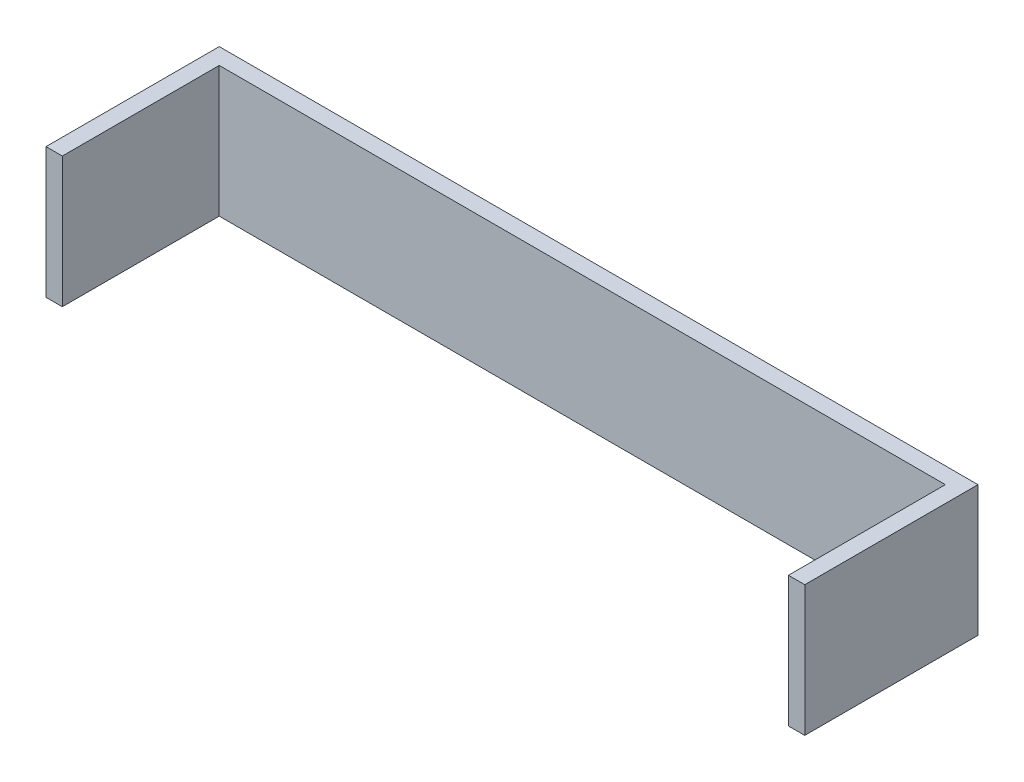
ISO-10303-21;
HEADER;
FILE_DESCRIPTION(('STEP AP214'),'2;1');
FILE_NAME('part.step','',(''),(''),'','','');
FILE_SCHEMA(('AUTOMOTIVE_DESIGN { 1 0 10303 214 1 1 1 1 }'));
ENDSEC;
DATA;
#1=APPLICATION_CONTEXT('core data for automotive mechanical design processes');
#2=APPLICATION_PROTOCOL_DEFINITION('international standard','automotive_design',2000,#1);
#3=PRODUCT_CONTEXT('',#1,'mechanical');
#4=PRODUCT('Part','Part','',(#3));
#5=PRODUCT_RELATED_PRODUCT_CATEGORY('part','',(#4));
#6=PRODUCT_DEFINITION_FORMATION('','',#4);
#7=PRODUCT_DEFINITION_CONTEXT('part definition',#1,'design');
#8=PRODUCT_DEFINITION('design','',#6,#7);
#9=PRODUCT_DEFINITION_SHAPE('','',#8);
#10=(LENGTH_UNIT() NAMED_UNIT(*) SI_UNIT(.MILLI.,.METRE.));
#11=(NAMED_UNIT(*) PLANE_ANGLE_UNIT() SI_UNIT($,.RADIAN.));
#12=(NAMED_UNIT(*) SI_UNIT($,.STERADIAN.) SOLID_ANGLE_UNIT());
#13=UNCERTAINTY_MEASURE_WITH_UNIT(LENGTH_MEASURE(1.E-05),#10,'distance_accuracy_value','');
#14=(GEOMETRIC_REPRESENTATION_CONTEXT(3) GLOBAL_UNCERTAINTY_ASSIGNED_CONTEXT((#13)) GLOBAL_UNIT_ASSIGNED_CONTEXT((#10,
#11,#12)) REPRESENTATION_CONTEXT('',''));
#15=CARTESIAN_POINT('',(0.,0.,0.));
#16=DIRECTION('',(0.,0.,1.));
#17=DIRECTION('',(1.,0.,0.));
#18=AXIS2_PLACEMENT_3D('',#15,#16,#17);
#19=CARTESIAN_POINT('',(0.,0.,3.175));
#20=DIRECTION('',(0.,0.,-1.));
#21=DIRECTION('',(-1.,0.,0.));
#22=AXIS2_PLACEMENT_3D('',#19,#20,#21);
#23=PLANE('',#22);
#24=DIRECTION('',(1.,0.,0.));
#25=VECTOR('',#24,1.);
#26=CARTESIAN_POINT('',(-73.81875,-12.7,3.175));
#27=LINE('',#26,#25);
#28=CARTESIAN_POINT('',(-70.64375,-12.7,3.175));
#29=VERTEX_POINT('',#28);
#30=CARTESIAN_POINT('',(70.64375,-12.7,3.175));
#31=VERTEX_POINT('',#30);
#32=EDGE_CURVE('E64',#29,#31,#27,.T.);
#33=ORIENTED_EDGE('',*,*,#32,.T.);
#34=DIRECTION('',(0.,1.,0.));
#35=VECTOR('',#34,1.);
#36=CARTESIAN_POINT('',(70.64375,12.7,3.175));
#37=LINE('',#36,#35);
#38=CARTESIAN_POINT('',(70.64375,12.7,3.175));
#39=VERTEX_POINT('',#38);
#40=EDGE_CURVE('E59',#31,#39,#37,.T.);
#41=ORIENTED_EDGE('',*,*,#40,.T.);
#42=DIRECTION('',(-1.,0.,0.));
#43=VECTOR('',#42,1.);
#44=CARTESIAN_POINT('',(-73.81875,12.7,3.175));
#45=LINE('',#44,#43);
#46=CARTESIAN_POINT('',(-70.64375,12.7,3.175));
#47=VERTEX_POINT('',#46);
#48=EDGE_CURVE('E170',#39,#47,#45,.T.);
#49=ORIENTED_EDGE('',*,*,#48,.T.);
#50=DIRECTION('',(0.,1.,0.));
#51=VECTOR('',#50,1.);
#52=CARTESIAN_POINT('',(-70.64375,12.7,3.175));
#53=LINE('',#52,#51);
#54=EDGE_CURVE('E144',#29,#47,#53,.T.);
#55=ORIENTED_EDGE('',*,*,#54,.F.);
#56=EDGE_LOOP('',(#33,#41,#49,#55));
#57=FACE_BOUND('',#56,.T.);
#58=ADVANCED_FACE('F43',(#57),#23,.F.);
#59=CARTESIAN_POINT('',(73.81875,-12.7,3.175));
#60=DIRECTION('',(-1.,0.,0.));
#61=DIRECTION('',(0.,0.,1.));
#62=AXIS2_PLACEMENT_3D('',#59,#60,#61);
#63=PLANE('',#62);
#64=DIRECTION('',(0.,1.,0.));
#65=VECTOR('',#64,1.);
#66=CARTESIAN_POINT('',(73.81875,-12.7,0.));
#67=LINE('',#66,#65);
#68=CARTESIAN_POINT('',(73.81875,-12.7,0.));
#69=VERTEX_POINT('',#68);
#70=CARTESIAN_POINT('',(73.81875,12.7,0.));
#71=VERTEX_POINT('',#70);
#72=EDGE_CURVE('E113',#69,#71,#67,.T.);
#73=ORIENTED_EDGE('',*,*,#72,.T.);
#74=DIRECTION('',(0.,0.,-1.));
#75=VECTOR('',#74,1.);
#76=CARTESIAN_POINT('',(73.81875,12.7,3.175));
#77=LINE('',#76,#75);
#78=CARTESIAN_POINT('',(73.81875,12.7,33.71088));
#79=VERTEX_POINT('',#78);
#80=EDGE_CURVE('E11',#79,#71,#77,.T.);
#81=ORIENTED_EDGE('',*,*,#80,.F.);
#82=DIRECTION('',(0.,-1.,0.));
#83=VECTOR('',#82,1.);
#84=CARTESIAN_POINT('',(73.81875,12.7,33.71088));
#85=LINE('',#84,#83);
#86=CARTESIAN_POINT('',(73.81875,-12.7,33.71088));
#87=VERTEX_POINT('',#86);
#88=EDGE_CURVE('E110',#79,#87,#85,.T.);
#89=ORIENTED_EDGE('',*,*,#88,.T.);
#90=DIRECTION('',(0.,0.,-1.));
#91=VECTOR('',#90,1.);
#92=CARTESIAN_POINT('',(73.81875,-12.7,3.175));
#93=LINE('',#92,#91);
#94=EDGE_CURVE('E176',#87,#69,#93,.T.);
#95=ORIENTED_EDGE('',*,*,#94,.T.);
#96=EDGE_LOOP('',(#73,#81,#89,#95));
#97=FACE_BOUND('',#96,.T.);
#98=ADVANCED_FACE('F45',(#97),#63,.F.);
#99=CARTESIAN_POINT('',(-73.81875,12.7,3.175));
#100=DIRECTION('',(0.,-1.,0.));
#101=DIRECTION('',(0.,0.,-1.));
#102=AXIS2_PLACEMENT_3D('',#99,#100,#101);
#103=PLANE('',#102);
#104=DIRECTION('',(-1.,0.,0.));
#105=VECTOR('',#104,1.);
#106=CARTESIAN_POINT('',(-73.81875,12.7,0.));
#107=LINE('',#106,#105);
#108=CARTESIAN_POINT('',(-73.81875,12.7,0.));
#109=VERTEX_POINT('',#108);
#110=EDGE_CURVE('E179',#71,#109,#107,.T.);
#111=ORIENTED_EDGE('',*,*,#110,.T.);
#112=DIRECTION('',(0.,0.,-1.));
#113=VECTOR('',#112,1.);
#114=CARTESIAN_POINT('',(-73.81875,12.7,3.175));
#115=LINE('',#114,#113);
#116=CARTESIAN_POINT('',(-73.81875,12.7,33.71088));
#117=VERTEX_POINT('',#116);
#118=EDGE_CURVE('E52',#117,#109,#115,.T.);
#119=ORIENTED_EDGE('',*,*,#118,.F.);
#120=DIRECTION('',(-1.,0.,0.));
#121=VECTOR('',#120,1.);
#122=CARTESIAN_POINT('',(-73.81875,12.7,33.71088));
#123=LINE('',#122,#121);
#124=CARTESIAN_POINT('',(-70.64375,12.7,33.71088));
#125=VERTEX_POINT('',#124);
#126=EDGE_CURVE('E155',#125,#117,#123,.T.);
#127=ORIENTED_EDGE('',*,*,#126,.F.);
#128=DIRECTION('',(0.,0.,-1.));
#129=VECTOR('',#128,1.);
#130=CARTESIAN_POINT('',(-70.64375,12.7,33.71088));
#131=LINE('',#130,#129);
#132=EDGE_CURVE('E159',#125,#47,#131,.T.);
#133=ORIENTED_EDGE('',*,*,#132,.T.);
#134=ORIENTED_EDGE('',*,*,#48,.F.);
#135=DIRECTION('',(0.,0.,-1.));
#136=VECTOR('',#135,1.);
#137=CARTESIAN_POINT('',(70.64375,12.7,33.71088));
#138=LINE('',#137,#136);
#139=CARTESIAN_POINT('',(70.64375,12.7,33.71088));
#140=VERTEX_POINT('',#139);
#141=EDGE_CURVE('E128',#140,#39,#138,.T.);
#142=ORIENTED_EDGE('',*,*,#141,.F.);
#143=DIRECTION('',(1.,0.,0.));
#144=VECTOR('',#143,1.);
#145=CARTESIAN_POINT('',(73.81875,12.7,33.71088));
#146=LINE('',#145,#144);
#147=EDGE_CURVE('E120',#140,#79,#146,.T.);
#148=ORIENTED_EDGE('',*,*,#147,.T.);
#149=ORIENTED_EDGE('',*,*,#80,.T.);
#150=EDGE_LOOP('',(#111,#119,#127,#133,#134,#142,#148,#149));
#151=FACE_BOUND('',#150,.T.);
#152=ADVANCED_FACE('F126',(#151),#103,.F.);
#153=CARTESIAN_POINT('',(-73.81875,-12.7,3.175));
#154=DIRECTION('',(1.,0.,0.));
#155=DIRECTION('',(0.,0.,-1.));
#156=AXIS2_PLACEMENT_3D('',#153,#154,#155);
#157=PLANE('',#156);
#158=DIRECTION('',(0.,-1.,0.));
#159=VECTOR('',#158,1.);
#160=CARTESIAN_POINT('',(-73.81875,-12.7,0.));
#161=LINE('',#160,#159);
#162=CARTESIAN_POINT('',(-73.81875,-12.7,0.));
#163=VERTEX_POINT('',#162);
#164=EDGE_CURVE('E182',#109,#163,#161,.T.);
#165=ORIENTED_EDGE('',*,*,#164,.T.);
#166=DIRECTION('',(0.,0.,-1.));
#167=VECTOR('',#166,1.);
#168=CARTESIAN_POINT('',(-73.81875,-12.7,3.175));
#169=LINE('',#168,#167);
#170=CARTESIAN_POINT('',(-73.81875,-12.7,33.71088));
#171=VERTEX_POINT('',#170);
#172=EDGE_CURVE('E189',#171,#163,#169,.T.);
#173=ORIENTED_EDGE('',*,*,#172,.F.);
#174=DIRECTION('',(0.,-1.,0.));
#175=VECTOR('',#174,1.);
#176=CARTESIAN_POINT('',(-73.81875,12.7,33.71088));
#177=LINE('',#176,#175);
#178=EDGE_CURVE('E145',#117,#171,#177,.T.);
#179=ORIENTED_EDGE('',*,*,#178,.F.);
#180=ORIENTED_EDGE('',*,*,#118,.T.);
#181=EDGE_LOOP('',(#165,#173,#179,#180));
#182=FACE_BOUND('',#181,.T.);
#183=ADVANCED_FACE('F197',(#182),#157,.F.);
#184=CARTESIAN_POINT('',(-73.81875,-12.7,3.175));
#185=DIRECTION('',(0.,1.,0.));
#186=DIRECTION('',(0.,0.,1.));
#187=AXIS2_PLACEMENT_3D('',#184,#185,#186);
#188=PLANE('',#187);
#189=DIRECTION('',(1.,0.,0.));
#190=VECTOR('',#189,1.);
#191=CARTESIAN_POINT('',(-73.81875,-12.7,0.));
#192=LINE('',#191,#190);
#193=EDGE_CURVE('E173',#163,#69,#192,.T.);
#194=ORIENTED_EDGE('',*,*,#193,.T.);
#195=ORIENTED_EDGE('',*,*,#94,.F.);
#196=DIRECTION('',(-1.,0.,0.));
#197=VECTOR('',#196,1.);
#198=CARTESIAN_POINT('',(73.81875,-12.7,33.71088));
#199=LINE('',#198,#197);
#200=CARTESIAN_POINT('',(70.64375,-12.7,33.71088));
#201=VERTEX_POINT('',#200);
#202=EDGE_CURVE('E123',#87,#201,#199,.T.);
#203=ORIENTED_EDGE('',*,*,#202,.T.);
#204=DIRECTION('',(0.,0.,-1.));
#205=VECTOR('',#204,1.);
#206=CARTESIAN_POINT('',(70.64375,-12.7,33.71088));
#207=LINE('',#206,#205);
#208=EDGE_CURVE('E137',#201,#31,#207,.T.);
#209=ORIENTED_EDGE('',*,*,#208,.T.);
#210=ORIENTED_EDGE('',*,*,#32,.F.);
#211=DIRECTION('',(0.,0.,-1.));
#212=VECTOR('',#211,1.);
#213=CARTESIAN_POINT('',(-70.64375,-12.7,33.71088));
#214=LINE('',#213,#212);
#215=CARTESIAN_POINT('',(-70.64375,-12.7,33.71088));
#216=VERTEX_POINT('',#215);
#217=EDGE_CURVE('E166',#216,#29,#214,.T.);
#218=ORIENTED_EDGE('',*,*,#217,.F.);
#219=DIRECTION('',(1.,0.,0.));
#220=VECTOR('',#219,1.);
#221=CARTESIAN_POINT('',(-73.81875,-12.7,33.71088));
#222=LINE('',#221,#220);
#223=EDGE_CURVE('E149',#171,#216,#222,.T.);
#224=ORIENTED_EDGE('',*,*,#223,.F.);
#225=ORIENTED_EDGE('',*,*,#172,.T.);
#226=EDGE_LOOP('',(#194,#195,#203,#209,#210,#218,#224,#225));
#227=FACE_BOUND('',#226,.T.);
#228=ADVANCED_FACE('F203',(#227),#188,.F.);
#229=CARTESIAN_POINT('',(0.,0.,0.));
#230=DIRECTION('',(0.,0.,-1.));
#231=DIRECTION('',(-1.,0.,0.));
#232=AXIS2_PLACEMENT_3D('',#229,#230,#231);
#233=PLANE('',#232);
#234=ORIENTED_EDGE('',*,*,#72,.F.);
#235=ORIENTED_EDGE('',*,*,#193,.F.);
#236=ORIENTED_EDGE('',*,*,#164,.F.);
#237=ORIENTED_EDGE('',*,*,#110,.F.);
#238=EDGE_LOOP('',(#234,#235,#236,#237));
#239=FACE_BOUND('',#238,.T.);
#240=ADVANCED_FACE('F201',(#239),#233,.T.);
#241=CARTESIAN_POINT('',(-70.64375,12.7,33.71088));
#242=DIRECTION('',(-1.,0.,0.));
#243=DIRECTION('',(0.,0.,1.));
#244=AXIS2_PLACEMENT_3D('',#241,#242,#243);
#245=PLANE('',#244);
#246=ORIENTED_EDGE('',*,*,#54,.T.);
#247=ORIENTED_EDGE('',*,*,#132,.F.);
#248=DIRECTION('',(0.,1.,0.));
#249=VECTOR('',#248,1.);
#250=CARTESIAN_POINT('',(-70.64375,12.7,33.71088));
#251=LINE('',#250,#249);
#252=EDGE_CURVE('E152',#216,#125,#251,.T.);
#253=ORIENTED_EDGE('',*,*,#252,.F.);
#254=ORIENTED_EDGE('',*,*,#217,.T.);
#255=EDGE_LOOP('',(#246,#247,#253,#254));
#256=FACE_BOUND('',#255,.T.);
#257=ADVANCED_FACE('F211',(#256),#245,.F.);
#258=CARTESIAN_POINT('',(0.,0.,33.71088));
#259=DIRECTION('',(0.,0.,1.));
#260=DIRECTION('',(1.,0.,0.));
#261=AXIS2_PLACEMENT_3D('',#258,#259,#260);
#262=PLANE('',#261);
#263=ORIENTED_EDGE('',*,*,#178,.T.);
#264=ORIENTED_EDGE('',*,*,#223,.T.);
#265=ORIENTED_EDGE('',*,*,#252,.T.);
#266=ORIENTED_EDGE('',*,*,#126,.T.);
#267=EDGE_LOOP('',(#263,#264,#265,#266));
#268=FACE_BOUND('',#267,.T.);
#269=ADVANCED_FACE('F208',(#268),#262,.T.);
#270=CARTESIAN_POINT('',(70.64375,12.7,33.71088));
#271=DIRECTION('',(-1.,0.,0.));
#272=DIRECTION('',(0.,0.,1.));
#273=AXIS2_PLACEMENT_3D('',#270,#271,#272);
#274=PLANE('',#273);
#275=ORIENTED_EDGE('',*,*,#40,.F.);
#276=ORIENTED_EDGE('',*,*,#208,.F.);
#277=DIRECTION('',(0.,1.,0.));
#278=VECTOR('',#277,1.);
#279=CARTESIAN_POINT('',(70.64375,12.7,33.71088));
#280=LINE('',#279,#278);
#281=EDGE_CURVE('E130',#201,#140,#280,.T.);
#282=ORIENTED_EDGE('',*,*,#281,.T.);
#283=ORIENTED_EDGE('',*,*,#141,.T.);
#284=EDGE_LOOP('',(#275,#276,#282,#283));
#285=FACE_BOUND('',#284,.T.);
#286=ADVANCED_FACE('F213',(#285),#274,.T.);
#287=CARTESIAN_POINT('',(0.,0.,33.71088));
#288=DIRECTION('',(0.,0.,1.));
#289=DIRECTION('',(-1.,0.,0.));
#290=AXIS2_PLACEMENT_3D('',#287,#288,#289);
#291=PLANE('',#290);
#292=ORIENTED_EDGE('',*,*,#88,.F.);
#293=ORIENTED_EDGE('',*,*,#147,.F.);
#294=ORIENTED_EDGE('',*,*,#281,.F.);
#295=ORIENTED_EDGE('',*,*,#202,.F.);
#296=EDGE_LOOP('',(#292,#293,#294,#295));
#297=FACE_BOUND('',#296,.T.);
#298=ADVANCED_FACE('F118',(#297),#291,.T.);
#299=CLOSED_SHELL('',(#58,#98,#152,#183,#228,#240,#257,#269,#286,#298));
#300=MANIFOLD_SOLID_BREP('B2',#299);
#301=ADVANCED_BREP_SHAPE_REPRESENTATION('',(#18,#300),#14);
#302=SHAPE_DEFINITION_REPRESENTATION(#9,#301);
ENDSEC;
END-ISO-10303-21;
